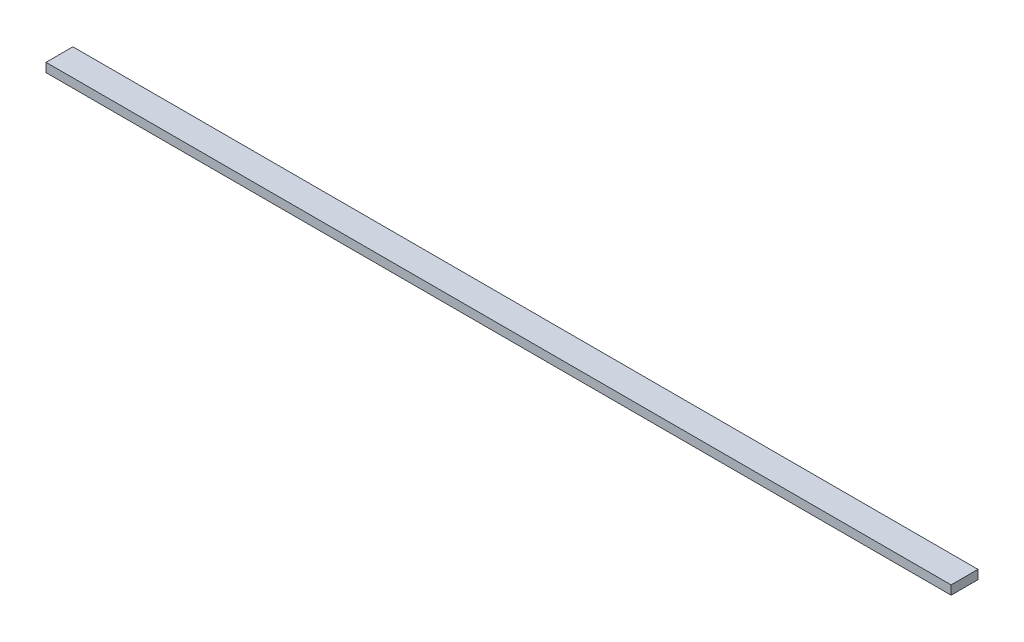
ISO-10303-21;
HEADER;
FILE_DESCRIPTION(('STEP AP214'),'2;1');
FILE_NAME('part.step','',(''),(''),'','','');
FILE_SCHEMA(('AUTOMOTIVE_DESIGN { 1 0 10303 214 1 1 1 1 }'));
ENDSEC;
DATA;
#1=APPLICATION_CONTEXT('core data for automotive mechanical design processes');
#2=APPLICATION_PROTOCOL_DEFINITION('international standard','automotive_design',2000,#1);
#3=PRODUCT_CONTEXT('',#1,'mechanical');
#4=PRODUCT('Part','Part','',(#3));
#5=PRODUCT_RELATED_PRODUCT_CATEGORY('part','',(#4));
#6=PRODUCT_DEFINITION_FORMATION('','',#4);
#7=PRODUCT_DEFINITION_CONTEXT('part definition',#1,'design');
#8=PRODUCT_DEFINITION('design','',#6,#7);
#9=PRODUCT_DEFINITION_SHAPE('','',#8);
#10=(LENGTH_UNIT() NAMED_UNIT(*) SI_UNIT(.MILLI.,.METRE.));
#11=(NAMED_UNIT(*) PLANE_ANGLE_UNIT() SI_UNIT($,.RADIAN.));
#12=(NAMED_UNIT(*) SI_UNIT($,.STERADIAN.) SOLID_ANGLE_UNIT());
#13=UNCERTAINTY_MEASURE_WITH_UNIT(LENGTH_MEASURE(1.E-05),#10,'distance_accuracy_value','');
#14=(GEOMETRIC_REPRESENTATION_CONTEXT(3) GLOBAL_UNCERTAINTY_ASSIGNED_CONTEXT((#13)) GLOBAL_UNIT_ASSIGNED_CONTEXT((#10,
#11,#12)) REPRESENTATION_CONTEXT('',''));
#15=CARTESIAN_POINT('',(0.,0.,0.));
#16=DIRECTION('',(0.,0.,1.));
#17=DIRECTION('',(1.,0.,0.));
#18=AXIS2_PLACEMENT_3D('',#15,#16,#17);
#19=CARTESIAN_POINT('',(-505.,10.,-14.9999999999999));
#20=DIRECTION('',(1.,0.,0.));
#21=DIRECTION('',(0.,0.,-1.));
#22=AXIS2_PLACEMENT_3D('',#19,#20,#21);
#23=PLANE('',#22);
#24=DIRECTION('',(0.,0.,1.));
#25=VECTOR('',#24,1.);
#26=CARTESIAN_POINT('',(-505.,0.,-14.9999999999999));
#27=LINE('',#26,#25);
#28=CARTESIAN_POINT('',(-505.,0.,-14.9999999999999));
#29=VERTEX_POINT('',#28);
#30=CARTESIAN_POINT('',(-505.,0.,15.0000000000001));
#31=VERTEX_POINT('',#30);
#32=EDGE_CURVE('E95',#29,#31,#27,.T.);
#33=ORIENTED_EDGE('',*,*,#32,.T.);
#34=DIRECTION('',(0.,-1.,0.));
#35=VECTOR('',#34,1.);
#36=CARTESIAN_POINT('',(-505.,10.,15.0000000000001));
#37=LINE('',#36,#35);
#38=CARTESIAN_POINT('',(-505.,10.,15.0000000000001));
#39=VERTEX_POINT('',#38);
#40=EDGE_CURVE('E11',#39,#31,#37,.T.);
#41=ORIENTED_EDGE('',*,*,#40,.F.);
#42=DIRECTION('',(0.,0.,1.));
#43=VECTOR('',#42,1.);
#44=CARTESIAN_POINT('',(-505.,10.,-14.9999999999999));
#45=LINE('',#44,#43);
#46=CARTESIAN_POINT('',(-505.,10.,-14.9999999999999));
#47=VERTEX_POINT('',#46);
#48=EDGE_CURVE('E83',#47,#39,#45,.T.);
#49=ORIENTED_EDGE('',*,*,#48,.F.);
#50=DIRECTION('',(0.,-1.,0.));
#51=VECTOR('',#50,1.);
#52=CARTESIAN_POINT('',(-505.,10.,-14.9999999999999));
#53=LINE('',#52,#51);
#54=EDGE_CURVE('E91',#47,#29,#53,.T.);
#55=ORIENTED_EDGE('',*,*,#54,.T.);
#56=EDGE_LOOP('',(#33,#41,#49,#55));
#57=FACE_BOUND('',#56,.T.);
#58=ADVANCED_FACE('F32',(#57),#23,.F.);
#59=CARTESIAN_POINT('',(-505.,10.,15.0000000000001));
#60=DIRECTION('',(0.,0.,-1.));
#61=DIRECTION('',(-1.,0.,0.));
#62=AXIS2_PLACEMENT_3D('',#59,#60,#61);
#63=PLANE('',#62);
#64=DIRECTION('',(1.,0.,0.));
#65=VECTOR('',#64,1.);
#66=CARTESIAN_POINT('',(-505.,0.,15.0000000000001));
#67=LINE('',#66,#65);
#68=CARTESIAN_POINT('',(505.,0.,15.));
#69=VERTEX_POINT('',#68);
#70=EDGE_CURVE('E87',#31,#69,#67,.T.);
#71=ORIENTED_EDGE('',*,*,#70,.T.);
#72=DIRECTION('',(0.,-1.,0.));
#73=VECTOR('',#72,1.);
#74=CARTESIAN_POINT('',(505.,10.,15.));
#75=LINE('',#74,#73);
#76=CARTESIAN_POINT('',(505.,10.,15.));
#77=VERTEX_POINT('',#76);
#78=EDGE_CURVE('E40',#77,#69,#75,.T.);
#79=ORIENTED_EDGE('',*,*,#78,.F.);
#80=DIRECTION('',(1.,0.,0.));
#81=VECTOR('',#80,1.);
#82=CARTESIAN_POINT('',(-505.,10.,15.0000000000001));
#83=LINE('',#82,#81);
#84=EDGE_CURVE('E78',#39,#77,#83,.T.);
#85=ORIENTED_EDGE('',*,*,#84,.F.);
#86=ORIENTED_EDGE('',*,*,#40,.T.);
#87=EDGE_LOOP('',(#71,#79,#85,#86));
#88=FACE_BOUND('',#87,.T.);
#89=ADVANCED_FACE('F86',(#88),#63,.F.);
#90=CARTESIAN_POINT('',(505.,10.,-14.9999999999999));
#91=DIRECTION('',(-1.,0.,0.));
#92=DIRECTION('',(0.,0.,1.));
#93=AXIS2_PLACEMENT_3D('',#90,#91,#92);
#94=PLANE('',#93);
#95=DIRECTION('',(0.,0.,-1.));
#96=VECTOR('',#95,1.);
#97=CARTESIAN_POINT('',(505.,0.,-14.9999999999999));
#98=LINE('',#97,#96);
#99=CARTESIAN_POINT('',(505.,0.,-14.9999999999999));
#100=VERTEX_POINT('',#99);
#101=EDGE_CURVE('E65',#69,#100,#98,.T.);
#102=ORIENTED_EDGE('',*,*,#101,.T.);
#103=DIRECTION('',(0.,-1.,0.));
#104=VECTOR('',#103,1.);
#105=CARTESIAN_POINT('',(505.,10.,-14.9999999999999));
#106=LINE('',#105,#104);
#107=CARTESIAN_POINT('',(505.,10.,-14.9999999999999));
#108=VERTEX_POINT('',#107);
#109=EDGE_CURVE('E88',#108,#100,#106,.T.);
#110=ORIENTED_EDGE('',*,*,#109,.F.);
#111=DIRECTION('',(0.,0.,-1.));
#112=VECTOR('',#111,1.);
#113=CARTESIAN_POINT('',(505.,10.,-14.9999999999999));
#114=LINE('',#113,#112);
#115=EDGE_CURVE('E81',#77,#108,#114,.T.);
#116=ORIENTED_EDGE('',*,*,#115,.F.);
#117=ORIENTED_EDGE('',*,*,#78,.T.);
#118=EDGE_LOOP('',(#102,#110,#116,#117));
#119=FACE_BOUND('',#118,.T.);
#120=ADVANCED_FACE('F89',(#119),#94,.F.);
#121=CARTESIAN_POINT('',(-505.,10.,-14.9999999999999));
#122=DIRECTION('',(0.,0.,1.));
#123=DIRECTION('',(1.,0.,0.));
#124=AXIS2_PLACEMENT_3D('',#121,#122,#123);
#125=PLANE('',#124);
#126=DIRECTION('',(-1.,0.,0.));
#127=VECTOR('',#126,1.);
#128=CARTESIAN_POINT('',(-505.,0.,-14.9999999999999));
#129=LINE('',#128,#127);
#130=EDGE_CURVE('E71',#100,#29,#129,.T.);
#131=ORIENTED_EDGE('',*,*,#130,.T.);
#132=ORIENTED_EDGE('',*,*,#54,.F.);
#133=DIRECTION('',(-1.,0.,0.));
#134=VECTOR('',#133,1.);
#135=CARTESIAN_POINT('',(-505.,10.,-14.9999999999999));
#136=LINE('',#135,#134);
#137=EDGE_CURVE('E48',#108,#47,#136,.T.);
#138=ORIENTED_EDGE('',*,*,#137,.F.);
#139=ORIENTED_EDGE('',*,*,#109,.T.);
#140=EDGE_LOOP('',(#131,#132,#138,#139));
#141=FACE_BOUND('',#140,.T.);
#142=ADVANCED_FACE('F102',(#141),#125,.F.);
#143=CARTESIAN_POINT('',(0.,10.,0.));
#144=DIRECTION('',(0.,1.,0.));
#145=DIRECTION('',(0.,0.,1.));
#146=AXIS2_PLACEMENT_3D('',#143,#144,#145);
#147=PLANE('',#146);
#148=ORIENTED_EDGE('',*,*,#48,.T.);
#149=ORIENTED_EDGE('',*,*,#84,.T.);
#150=ORIENTED_EDGE('',*,*,#115,.T.);
#151=ORIENTED_EDGE('',*,*,#137,.T.);
#152=EDGE_LOOP('',(#148,#149,#150,#151));
#153=FACE_BOUND('',#152,.T.);
#154=ADVANCED_FACE('F79',(#153),#147,.T.);
#155=CARTESIAN_POINT('',(0.,0.,0.));
#156=DIRECTION('',(0.,1.,0.));
#157=DIRECTION('',(0.,0.,1.));
#158=AXIS2_PLACEMENT_3D('',#155,#156,#157);
#159=PLANE('',#158);
#160=ORIENTED_EDGE('',*,*,#32,.F.);
#161=ORIENTED_EDGE('',*,*,#130,.F.);
#162=ORIENTED_EDGE('',*,*,#101,.F.);
#163=ORIENTED_EDGE('',*,*,#70,.F.);
#164=EDGE_LOOP('',(#160,#161,#162,#163));
#165=FACE_BOUND('',#164,.T.);
#166=ADVANCED_FACE('F105',(#165),#159,.F.);
#167=CLOSED_SHELL('',(#58,#89,#120,#142,#154,#166));
#168=MANIFOLD_SOLID_BREP('B2',#167);
#169=ADVANCED_BREP_SHAPE_REPRESENTATION('',(#18,#168),#14);
#170=SHAPE_DEFINITION_REPRESENTATION(#9,#169);
ENDSEC;
END-ISO-10303-21;
